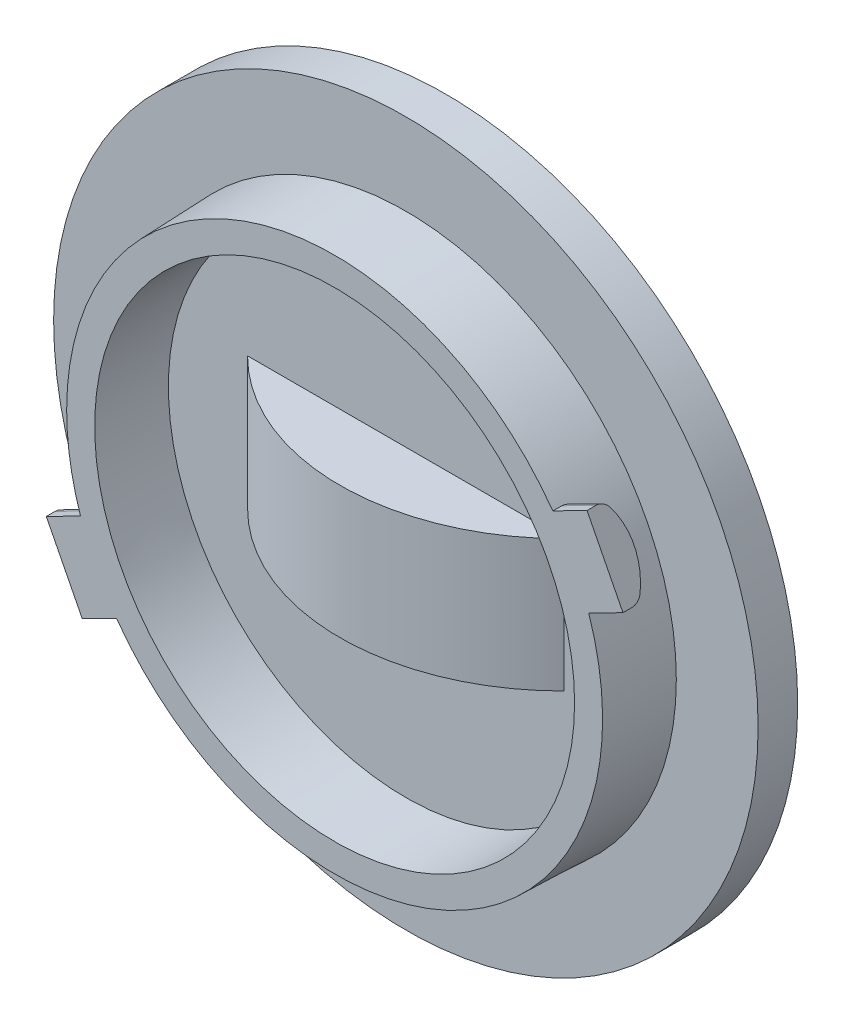
ISO-10303-21;
HEADER;
FILE_DESCRIPTION(('STEP AP214'),'2;1');
FILE_NAME('part.step','',(''),(''),'','','');
FILE_SCHEMA(('AUTOMOTIVE_DESIGN { 1 0 10303 214 1 1 1 1 }'));
ENDSEC;
DATA;
#1=APPLICATION_CONTEXT('core data for automotive mechanical design processes');
#2=APPLICATION_PROTOCOL_DEFINITION('international standard','automotive_design',2000,#1);
#3=PRODUCT_CONTEXT('',#1,'mechanical');
#4=PRODUCT('Part','Part','',(#3));
#5=PRODUCT_RELATED_PRODUCT_CATEGORY('part','',(#4));
#6=PRODUCT_DEFINITION_FORMATION('','',#4);
#7=PRODUCT_DEFINITION_CONTEXT('part definition',#1,'design');
#8=PRODUCT_DEFINITION('design','',#6,#7);
#9=PRODUCT_DEFINITION_SHAPE('','',#8);
#10=(LENGTH_UNIT() NAMED_UNIT(*) SI_UNIT(.MILLI.,.METRE.));
#11=(NAMED_UNIT(*) PLANE_ANGLE_UNIT() SI_UNIT($,.RADIAN.));
#12=(NAMED_UNIT(*) SI_UNIT($,.STERADIAN.) SOLID_ANGLE_UNIT());
#13=UNCERTAINTY_MEASURE_WITH_UNIT(LENGTH_MEASURE(1.E-05),#10,'distance_accuracy_value','');
#14=(GEOMETRIC_REPRESENTATION_CONTEXT(3) GLOBAL_UNCERTAINTY_ASSIGNED_CONTEXT((#13)) GLOBAL_UNIT_ASSIGNED_CONTEXT((#10,
#11,#12)) REPRESENTATION_CONTEXT('',''));
#15=CARTESIAN_POINT('',(0.,0.,0.));
#16=DIRECTION('',(0.,0.,1.));
#17=DIRECTION('',(1.,0.,0.));
#18=AXIS2_PLACEMENT_3D('',#15,#16,#17);
#19=CARTESIAN_POINT('',(0.,0.,-10.18));
#20=DIRECTION('',(0.,0.,-1.));
#21=DIRECTION('',(-1.,0.,0.));
#22=AXIS2_PLACEMENT_3D('',#19,#20,#21);
#23=PLANE('',#22);
#24=CARTESIAN_POINT('',(-24.4705750281702,-1.15689074700472,-10.18));
#25=DIRECTION('',(0.,0.,-1.));
#26=DIRECTION('',(-1.,0.,0.));
#27=AXIS2_PLACEMENT_3D('',#24,#25,#26);
#28=CIRCLE('',#27,1.);
#29=CARTESIAN_POINT('',(-25.4705750281702,-1.15689074700472,-10.18));
#30=VERTEX_POINT('',#29);
#31=EDGE_CURVE('E328',#30,#30,#28,.T.);
#32=ORIENTED_EDGE('',*,*,#31,.F.);
#33=EDGE_LOOP('',(#32));
#34=FACE_BOUND('',#33,.T.);
#35=DIRECTION('',(0.,1.,0.));
#36=VECTOR('',#35,1.);
#37=CARTESIAN_POINT('',(-19.56253912602,0.,-10.18));
#38=LINE('',#37,#36);
#39=CARTESIAN_POINT('',(-19.5625391260178,5.064,-10.18));
#40=VERTEX_POINT('',#39);
#41=CARTESIAN_POINT('',(-19.5625391260178,3.064,-10.18));
#42=VERTEX_POINT('',#41);
#43=EDGE_CURVE('E43',#40,#42,#38,.F.);
#44=ORIENTED_EDGE('',*,*,#43,.T.);
#45=DIRECTION('',(-1.,0.,0.));
#46=VECTOR('',#45,1.);
#47=CARTESIAN_POINT('',(0.,3.064,-10.18));
#48=LINE('',#47,#46);
#49=CARTESIAN_POINT('',(-8.88546087398417,3.064,-10.18));
#50=VERTEX_POINT('',#49);
#51=EDGE_CURVE('E11',#42,#50,#48,.F.);
#52=ORIENTED_EDGE('',*,*,#51,.T.);
#53=DIRECTION('',(0.,1.,0.));
#54=VECTOR('',#53,1.);
#55=CARTESIAN_POINT('',(-8.885460873984,0.,-10.18));
#56=LINE('',#55,#54);
#57=CARTESIAN_POINT('',(-8.88546087398417,5.064,-10.18));
#58=VERTEX_POINT('',#57);
#59=EDGE_CURVE('E166',#50,#58,#56,.T.);
#60=ORIENTED_EDGE('',*,*,#59,.T.);
#61=DIRECTION('',(-1.,0.,0.));
#62=VECTOR('',#61,1.);
#63=CARTESIAN_POINT('',(0.,5.064,-10.18));
#64=LINE('',#63,#62);
#65=EDGE_CURVE('E336',#58,#40,#64,.T.);
#66=ORIENTED_EDGE('',*,*,#65,.T.);
#67=EDGE_LOOP('',(#44,#52,#60,#66));
#68=FACE_BOUND('',#67,.T.);
#69=CARTESIAN_POINT('',(-14.224,4.064,-10.18));
#70=DIRECTION('',(0.,0.,-1.));
#71=DIRECTION('',(-1.,0.,0.));
#72=AXIS2_PLACEMENT_3D('',#69,#70,#71);
#73=CIRCLE('',#72,13.35);
#74=CARTESIAN_POINT('',(-27.574,4.064,-10.18));
#75=VERTEX_POINT('',#74);
#76=EDGE_CURVE('E163',#75,#75,#73,.T.);
#77=ORIENTED_EDGE('',*,*,#76,.T.);
#78=EDGE_LOOP('',(#77));
#79=FACE_BOUND('',#78,.T.);
#80=CARTESIAN_POINT('',(-3.9774249718335,9.284890747006,-10.18));
#81=DIRECTION('',(0.,0.,-1.));
#82=DIRECTION('',(-1.,0.,0.));
#83=AXIS2_PLACEMENT_3D('',#80,#81,#82);
#84=CIRCLE('',#83,1.);
#85=CARTESIAN_POINT('',(-4.9774249718335,9.284890747006,-10.18));
#86=VERTEX_POINT('',#85);
#87=EDGE_CURVE('E323',#86,#86,#84,.T.);
#88=ORIENTED_EDGE('',*,*,#87,.F.);
#89=EDGE_LOOP('',(#88));
#90=FACE_BOUND('',#89,.T.);
#91=ADVANCED_FACE('F33',(#34,#68,#79,#90),#23,.T.);
#92=CARTESIAN_POINT('',(-14.224,1.564,0.));
#93=DIRECTION('',(0.,1.,0.));
#94=DIRECTION('',(0.,0.,1.));
#95=AXIS2_PLACEMENT_3D('',#92,#93,#94);
#96=PLANE('',#95);
#97=DIRECTION('',(-1.,0.,0.));
#98=VECTOR('',#97,1.);
#99=CARTESIAN_POINT('',(0.,1.564,-8.68));
#100=LINE('',#99,#98);
#101=CARTESIAN_POINT('',(-20.224,1.564,-8.68));
#102=VERTEX_POINT('',#101);
#103=CARTESIAN_POINT('',(-8.224,1.564,-8.68));
#104=VERTEX_POINT('',#103);
#105=EDGE_CURVE('E138',#102,#104,#100,.F.);
#106=ORIENTED_EDGE('',*,*,#105,.T.);
#107=CARTESIAN_POINT('',(-14.224,1.564,-14.63));
#108=DIRECTION('',(0.,1.,0.));
#109=DIRECTION('',(0.,0.,1.));
#110=AXIS2_PLACEMENT_3D('',#107,#108,#109);
#111=CIRCLE('',#110,8.45);
#112=EDGE_CURVE('E37',#102,#104,#111,.T.);
#113=ORIENTED_EDGE('',*,*,#112,.F.);
#114=EDGE_LOOP('',(#106,#113));
#115=FACE_BOUND('',#114,.T.);
#116=ADVANCED_FACE('F35',(#115),#96,.F.);
#117=CARTESIAN_POINT('',(-14.224,6.564,0.));
#118=DIRECTION('',(0.,1.,0.));
#119=DIRECTION('',(0.,0.,1.));
#120=AXIS2_PLACEMENT_3D('',#117,#118,#119);
#121=PLANE('',#120);
#122=CARTESIAN_POINT('',(-14.224,6.564,-14.63));
#123=DIRECTION('',(0.,1.,0.));
#124=DIRECTION('',(0.,0.,1.));
#125=AXIS2_PLACEMENT_3D('',#122,#123,#124);
#126=CIRCLE('',#125,8.45);
#127=CARTESIAN_POINT('',(-8.224,6.564,-8.68));
#128=VERTEX_POINT('',#127);
#129=CARTESIAN_POINT('',(-20.224,6.564,-8.68));
#130=VERTEX_POINT('',#129);
#131=EDGE_CURVE('E143',#128,#130,#126,.F.);
#132=ORIENTED_EDGE('',*,*,#131,.F.);
#133=DIRECTION('',(-1.,0.,0.));
#134=VECTOR('',#133,1.);
#135=CARTESIAN_POINT('',(0.,6.564,-8.68));
#136=LINE('',#135,#134);
#137=EDGE_CURVE('E154',#128,#130,#136,.T.);
#138=ORIENTED_EDGE('',*,*,#137,.T.);
#139=EDGE_LOOP('',(#132,#138));
#140=FACE_BOUND('',#139,.T.);
#141=ADVANCED_FACE('F277',(#140),#121,.T.);
#142=CARTESIAN_POINT('',(-14.224,1.564,-14.63));
#143=DIRECTION('',(0.,1.,0.));
#144=DIRECTION('',(0.,0.,1.));
#145=AXIS2_PLACEMENT_3D('',#142,#143,#144);
#146=CYLINDRICAL_SURFACE('',#145,8.45);
#147=ORIENTED_EDGE('',*,*,#131,.T.);
#148=DIRECTION('',(0.,1.,0.));
#149=VECTOR('',#148,1.);
#150=CARTESIAN_POINT('',(-20.224,0.,-8.68));
#151=LINE('',#150,#149);
#152=EDGE_CURVE('E150',#130,#102,#151,.F.);
#153=ORIENTED_EDGE('',*,*,#152,.T.);
#154=ORIENTED_EDGE('',*,*,#112,.T.);
#155=DIRECTION('',(0.,1.,0.));
#156=VECTOR('',#155,1.);
#157=CARTESIAN_POINT('',(-8.224,0.,-8.68));
#158=LINE('',#157,#156);
#159=EDGE_CURVE('E142',#104,#128,#158,.T.);
#160=ORIENTED_EDGE('',*,*,#159,.T.);
#161=EDGE_LOOP('',(#147,#153,#154,#160));
#162=FACE_BOUND('',#161,.T.);
#163=ADVANCED_FACE('F148',(#162),#146,.T.);
#164=CARTESIAN_POINT('',(0.,0.,-8.68));
#165=DIRECTION('',(0.,0.,-1.));
#166=DIRECTION('',(-1.,0.,0.));
#167=AXIS2_PLACEMENT_3D('',#164,#165,#166);
#168=PLANE('',#167);
#169=ORIENTED_EDGE('',*,*,#137,.F.);
#170=ORIENTED_EDGE('',*,*,#159,.F.);
#171=ORIENTED_EDGE('',*,*,#105,.F.);
#172=ORIENTED_EDGE('',*,*,#152,.F.);
#173=EDGE_LOOP('',(#169,#170,#171,#172));
#174=FACE_BOUND('',#173,.T.);
#175=CARTESIAN_POINT('',(-14.224,4.064,-8.68));
#176=DIRECTION('',(0.,0.,1.));
#177=DIRECTION('',(1.,0.,0.));
#178=AXIS2_PLACEMENT_3D('',#175,#176,#177);
#179=CIRCLE('',#178,9.00000000000015);
#180=CARTESIAN_POINT('',(-5.22399999999985,4.064,-8.68));
#181=VERTEX_POINT('',#180);
#182=EDGE_CURVE('E217',#181,#181,#179,.T.);
#183=ORIENTED_EDGE('',*,*,#182,.T.);
#184=EDGE_LOOP('',(#183));
#185=FACE_BOUND('',#184,.T.);
#186=ADVANCED_FACE('F152',(#174,#185),#168,.F.);
#187=CARTESIAN_POINT('',(-58.57091041054,-19.65420569825,-6.312050807569));
#188=DIRECTION('',(0.891006524188393,0.453990499739497,0.));
#189=DIRECTION('',(-0.453990499739497,0.891006524188393,0.));
#190=AXIS2_PLACEMENT_3D('',#187,#188,#189);
#191=CYLINDRICAL_SURFACE('',#190,0.5);
#192=DIRECTION('',(0.891006524188393,0.453990499739497,0.));
#193=VECTOR('',#192,1.);
#194=CARTESIAN_POINT('',(-3.40993684715936,8.17113259176898,-6.74506350946075));
#195=LINE('',#194,#193);
#196=CARTESIAN_POINT('',(-3.40993684715921,8.17113259176922,-6.74506350946097));
#197=VERTEX_POINT('',#196);
#198=CARTESIAN_POINT('',(-4.65252209977524,7.5380037823946,-6.74506350946078));
#199=VERTEX_POINT('',#198);
#200=EDGE_CURVE('E376',#197,#199,#195,.F.);
#201=ORIENTED_EDGE('',*,*,#200,.F.);
#202=CARTESIAN_POINT('',(-3.52343447209409,8.39388422281651,-6.312050807569));
#203=DIRECTION('',(0.891006524188393,0.453990499739497,0.));
#204=DIRECTION('',(-0.453990499739497,0.891006524188393,0.));
#205=AXIS2_PLACEMENT_3D('',#202,#203,#204);
#206=CIRCLE('',#205,0.5);
#207=CARTESIAN_POINT('',(-3.2964392222241,7.94838096072202,-6.312050807569));
#208=VERTEX_POINT('',#207);
#209=EDGE_CURVE('E272',#208,#197,#206,.T.);
#210=ORIENTED_EDGE('',*,*,#209,.F.);
#211=DIRECTION('',(0.891006524188393,0.453990499739497,0.));
#212=VECTOR('',#211,1.);
#213=CARTESIAN_POINT('',(-4.50852004066,7.330794936885,-6.312050807569));
#214=LINE('',#213,#212);
#215=CARTESIAN_POINT('',(-4.58300637958424,7.29284225156363,-6.31205080756894));
#216=VERTEX_POINT('',#215);
#217=EDGE_CURVE('E158',#216,#208,#214,.T.);
#218=ORIENTED_EDGE('',*,*,#217,.F.);
#219=CARTESIAN_POINT('',(-4.58300637958267,7.29284225156463,-6.31205080756887));
#220=CARTESIAN_POINT('',(-4.58211902532399,7.29326689250219,-6.34010161204957));
#221=CARTESIAN_POINT('',(-4.58199969177409,7.29600262277718,-6.36812796429022));
#222=CARTESIAN_POINT('',(-4.58328126314994,7.30587979040041,-6.42331053144108));
#223=CARTESIAN_POINT('',(-4.58467961113743,7.31301380892771,-6.45046813075209));
#224=CARTESIAN_POINT('',(-4.5889781283262,7.33147507139072,-6.50319481948987));
#225=CARTESIAN_POINT('',(-4.59187848461878,7.34280283765273,-6.52876371058148));
#226=CARTESIAN_POINT('',(-4.59913365805207,7.36929666210863,-6.57762370453765));
#227=CARTESIAN_POINT('',(-4.60348940257336,7.38446516614328,-6.60091334278601));
#228=CARTESIAN_POINT('',(-4.61362067187574,7.41832445705081,-6.64475631372771));
#229=CARTESIAN_POINT('',(-4.6194084032012,7.43704518602596,-6.66528364671262));
#230=CARTESIAN_POINT('',(-4.63226533361311,7.47733899246289,-6.70276627884086));
#231=CARTESIAN_POINT('',(-4.63933169828259,7.49890573294703,-6.71972930293742));
#232=CARTESIAN_POINT('',(-4.64878037261052,7.52698357200546,-6.73825935689551));
#233=CARTESIAN_POINT('',(-4.65063584659399,7.53246483339741,-6.74172060310438));
#234=CARTESIAN_POINT('',(-4.65252209977517,7.53800378239442,-6.74506350946082));
#235=B_SPLINE_CURVE_WITH_KNOTS('',3,(#219,#220,#221,#222,#223,#224,#225,#226,#227,#228,#229,
#230,#231,#232,#233,#234),.UNSPECIFIED.,.F.,.F.,(4,2,2,2,2,2,2,4),(0.,0.0840838207668479,
0.168026199559486,0.25197903679458,0.335985471537736,0.420734277244317,0.50529746724014,
0.525520310353774),.UNSPECIFIED.);
#236=EDGE_CURVE('E161',#216,#199,#235,.T.);
#237=ORIENTED_EDGE('',*,*,#236,.T.);
#238=EDGE_LOOP('',(#201,#210,#218,#237));
#239=FACE_BOUND('',#238,.T.);
#240=ADVANCED_FACE('F259',(#239),#191,.T.);
#241=CARTESIAN_POINT('',(33.93212,29.72309492654,-6.312050807569));
#242=DIRECTION('',(-0.891006524188393,-0.453990499739497,0.));
#243=DIRECTION('',(0.453990499739497,-0.891006524188393,0.));
#244=AXIS2_PLACEMENT_3D('',#241,#242,#243);
#245=CYLINDRICAL_SURFACE('',#244,0.5);
#246=CARTESIAN_POINT('',(-4.43141547157249,10.1758972711943,-6.312050807569));
#247=DIRECTION('',(-0.891006524188393,-0.453990499739497,0.));
#248=DIRECTION('',(0.453990499739497,-0.891006524188393,0.));
#249=AXIS2_PLACEMENT_3D('',#246,#247,#248);
#250=CIRCLE('',#249,0.5);
#251=CARTESIAN_POINT('',(-4.54491309650764,10.3986489022409,-6.74506350946121));
#252=VERTEX_POINT('',#251);
#253=CARTESIAN_POINT('',(-4.65841072144301,10.62140053329,-6.312050807569));
#254=VERTEX_POINT('',#253);
#255=EDGE_CURVE('E409',#252,#254,#250,.F.);
#256=ORIENTED_EDGE('',*,*,#255,.F.);
#257=DIRECTION('',(0.891006524188393,0.453990499739497,0.));
#258=VECTOR('',#257,1.);
#259=CARTESIAN_POINT('',(-4.54491309650826,10.3986489022403,-6.74506350946123));
#260=LINE('',#259,#258);
#261=CARTESIAN_POINT('',(-5.78749834912447,9.76552009286627,-6.74506350946122));
#262=VERTEX_POINT('',#261);
#263=EDGE_CURVE('E371',#262,#252,#260,.T.);
#264=ORIENTED_EDGE('',*,*,#263,.F.);
#265=CARTESIAN_POINT('',(-5.78749834912464,9.76552009286651,-6.74506350946121));
#266=CARTESIAN_POINT('',(-5.80175891588662,9.78574359152614,-6.73094756052362));
#267=CARTESIAN_POINT('',(-5.81547724440093,9.80486682357144,-6.71472187922432));
#268=CARTESIAN_POINT('',(-5.84140358289956,9.84043363892302,-6.67860204049876));
#269=CARTESIAN_POINT('',(-5.85361343018109,9.85688048990735,-6.65871242074983));
#270=CARTESIAN_POINT('',(-5.87614463310771,9.88668140905615,-6.61575820910445));
#271=CARTESIAN_POINT('',(-5.88646420560405,9.90003256008409,-6.59269065494097));
#272=CARTESIAN_POINT('',(-5.90484898579757,9.9232603221763,-6.54404921721269));
#273=CARTESIAN_POINT('',(-5.91291447478179,9.93313736681405,-6.51847564691202));
#274=CARTESIAN_POINT('',(-5.92702580665826,9.949752938816,-6.46347289228939));
#275=CARTESIAN_POINT('',(-5.93286621715199,9.95618824096055,-6.43389851510111));
#276=CARTESIAN_POINT('',(-5.94137602148812,9.96451057718513,-6.37357840309545));
#277=CARTESIAN_POINT('',(-5.94403531285673,9.9663831405161,-6.3428292548219));
#278=CARTESIAN_POINT('',(-5.9449778788017,9.96586182413023,-6.31205080756886));
#279=B_SPLINE_CURVE_WITH_KNOTS('',3,(#265,#266,#267,#268,#269,#270,#271,#272,#273,#274,#275,
#276,#277,#278),.UNSPECIFIED.,.F.,.F.,(4,2,2,2,2,2,4),(0.,0.0853568727200456,0.170608735682245,
0.25594060953047,0.341261830056113,0.433207613181306,0.525444625442435),.UNSPECIFIED.);
#280=CARTESIAN_POINT('',(-5.94497787880384,9.96586182413008,-6.31205080756893));
#281=VERTEX_POINT('',#280);
#282=EDGE_CURVE('E264',#262,#281,#279,.T.);
#283=ORIENTED_EDGE('',*,*,#282,.T.);
#284=DIRECTION('',(-0.891006524188393,-0.453990499739497,0.));
#285=VECTOR('',#284,1.);
#286=CARTESIAN_POINT('',(-4.658410721443,10.62140053329,-6.312050807569));
#287=LINE('',#286,#285);
#288=EDGE_CURVE('E404',#254,#281,#287,.T.);
#289=ORIENTED_EDGE('',*,*,#288,.F.);
#290=EDGE_LOOP('',(#256,#264,#283,#289));
#291=FACE_BOUND('',#290,.T.);
#292=ADVANCED_FACE('F254',(#291),#245,.T.);
#293=CARTESIAN_POINT('',(-4.50852004066,7.330794936885,-4.88));
#294=DIRECTION('',(0.453990499739497,-0.891006524188393,0.));
#295=DIRECTION('',(0.891006524188393,0.453990499739497,0.));
#296=AXIS2_PLACEMENT_3D('',#293,#294,#295);
#297=PLANE('',#296);
#298=DIRECTION('',(0.0314396863944734,0.0160193203421071,-0.999377269851178));
#299=VECTOR('',#298,1.);
#300=CARTESIAN_POINT('',(-4.59345245793074,7.28751970879848,-5.98));
#301=LINE('',#300,#299);
#302=CARTESIAN_POINT('',(-4.59345245792915,7.28751970879962,-5.97999999999987));
#303=VERTEX_POINT('',#302);
#304=EDGE_CURVE('E271',#303,#216,#301,.T.);
#305=ORIENTED_EDGE('',*,*,#304,.T.);
#306=ORIENTED_EDGE('',*,*,#217,.T.);
#307=DIRECTION('',(0.,0.,1.));
#308=VECTOR('',#307,1.);
#309=CARTESIAN_POINT('',(-3.296439222224,7.948380960722,-4.88));
#310=LINE('',#309,#308);
#311=CARTESIAN_POINT('',(-3.296439222224,7.948380960722,-5.98));
#312=VERTEX_POINT('',#311);
#313=EDGE_CURVE('E418',#312,#208,#310,.F.);
#314=ORIENTED_EDGE('',*,*,#313,.F.);
#315=DIRECTION('',(0.891006524188599,0.453990499739093,0.));
#316=VECTOR('',#315,1.);
#317=CARTESIAN_POINT('',(-4.593452457931,7.287519708799,-5.98));
#318=LINE('',#317,#316);
#319=EDGE_CURVE('E368',#303,#312,#318,.T.);
#320=ORIENTED_EDGE('',*,*,#319,.F.);
#321=EDGE_LOOP('',(#305,#306,#314,#320));
#322=FACE_BOUND('',#321,.T.);
#323=ADVANCED_FACE('F250',(#322),#297,.T.);
#324=CARTESIAN_POINT('',(-3.296439222224,7.948380960722,-4.88));
#325=DIRECTION('',(0.891006524188393,0.453990499739497,0.));
#326=DIRECTION('',(-0.453990499739497,0.891006524188393,0.));
#327=AXIS2_PLACEMENT_3D('',#324,#325,#326);
#328=PLANE('',#327);
#329=CARTESIAN_POINT('',(-3.97742497183391,9.28489074700505,-4.58));
#330=DIRECTION('',(0.891006524188393,0.453990499739497,0.));
#331=DIRECTION('',(-0.453990499739497,0.891006524188393,0.));
#332=AXIS2_PLACEMENT_3D('',#329,#330,#331);
#333=CIRCLE('',#332,2.5);
#334=EDGE_CURVE('E379',#252,#197,#333,.F.);
#335=ORIENTED_EDGE('',*,*,#334,.F.);
#336=ORIENTED_EDGE('',*,*,#255,.T.);
#337=DIRECTION('',(0.,0.,1.));
#338=VECTOR('',#337,1.);
#339=CARTESIAN_POINT('',(-4.658410721443,10.62140053329,-4.88));
#340=LINE('',#339,#338);
#341=CARTESIAN_POINT('',(-4.658410721443,10.62140053329,-5.98));
#342=VERTEX_POINT('',#341);
#343=EDGE_CURVE('E408',#342,#254,#340,.F.);
#344=ORIENTED_EDGE('',*,*,#343,.F.);
#345=DIRECTION('',(-0.453990499739252,0.891006524188518,0.));
#346=VECTOR('',#345,1.);
#347=CARTESIAN_POINT('',(-3.296439222224,7.948380960722,-5.98));
#348=LINE('',#347,#346);
#349=EDGE_CURVE('E365',#312,#342,#348,.T.);
#350=ORIENTED_EDGE('',*,*,#349,.F.);
#351=ORIENTED_EDGE('',*,*,#313,.T.);
#352=ORIENTED_EDGE('',*,*,#209,.T.);
#353=EDGE_LOOP('',(#335,#336,#344,#350,#351,#352));
#354=FACE_BOUND('',#353,.T.);
#355=ADVANCED_FACE('F246',(#354),#328,.T.);
#356=CARTESIAN_POINT('',(-4.658410721443,10.62140053329,-4.88));
#357=DIRECTION('',(-0.453990499739497,0.891006524188393,0.));
#358=DIRECTION('',(-0.891006524188393,-0.453990499739497,0.));
#359=AXIS2_PLACEMENT_3D('',#356,#357,#358);
#360=PLANE('',#359);
#361=ORIENTED_EDGE('',*,*,#343,.T.);
#362=ORIENTED_EDGE('',*,*,#288,.T.);
#363=DIRECTION('',(-0.0314396863944761,-0.0160193203421044,0.999377269851178));
#364=VECTOR('',#363,1.);
#365=CARTESIAN_POINT('',(-5.94497787880599,9.96586182412994,-6.312050807569));
#366=LINE('',#365,#364);
#367=CARTESIAN_POINT('',(-5.95542395714862,9.96053928136583,-5.97999999999976));
#368=VERTEX_POINT('',#367);
#369=EDGE_CURVE('E405',#281,#368,#366,.T.);
#370=ORIENTED_EDGE('',*,*,#369,.T.);
#371=DIRECTION('',(-0.891006524187765,-0.45399049974073,0.));
#372=VECTOR('',#371,1.);
#373=CARTESIAN_POINT('',(-4.658410721443,10.62140053329,-5.98));
#374=LINE('',#373,#372);
#375=EDGE_CURVE('E360',#342,#368,#374,.T.);
#376=ORIENTED_EDGE('',*,*,#375,.F.);
#377=EDGE_LOOP('',(#361,#362,#370,#376));
#378=FACE_BOUND('',#377,.T.);
#379=ADVANCED_FACE('F242',(#378),#360,.T.);
#380=CARTESIAN_POINT('',(-23.93947995934,0.7972050631146,-4.88));
#381=DIRECTION('',(-0.453990499739497,0.891006524188393,0.));
#382=DIRECTION('',(-0.891006524188393,-0.453990499739497,0.));
#383=AXIS2_PLACEMENT_3D('',#380,#381,#382);
#384=PLANE('',#383);
#385=DIRECTION('',(-0.0314396863826521,-0.016019320336083,-0.999377269851646));
#386=VECTOR('',#385,1.);
#387=CARTESIAN_POINT('',(-23.8545475420698,0.840480291200854,-5.98));
#388=LINE('',#387,#386);
#389=CARTESIAN_POINT('',(-23.8545475420712,0.840480291200395,-5.97999999999987));
#390=VERTEX_POINT('',#389);
#391=CARTESIAN_POINT('',(-23.8649936204141,0.835157748437371,-6.31205080756887));
#392=VERTEX_POINT('',#391);
#393=EDGE_CURVE('E398',#390,#392,#388,.T.);
#394=ORIENTED_EDGE('',*,*,#393,.T.);
#395=DIRECTION('',(-0.891006524188393,-0.453990499739497,0.));
#396=VECTOR('',#395,1.);
#397=CARTESIAN_POINT('',(29.3802919264403,27.9649858001542,-6.312050807569));
#398=LINE('',#397,#396);
#399=CARTESIAN_POINT('',(-25.1515607777778,0.179619039278523,-6.312050807569));
#400=VERTEX_POINT('',#399);
#401=EDGE_CURVE('E216',#400,#392,#398,.F.);
#402=ORIENTED_EDGE('',*,*,#401,.F.);
#403=DIRECTION('',(0.,0.,1.));
#404=VECTOR('',#403,1.);
#405=CARTESIAN_POINT('',(-25.15156077778,0.1796190392778,-4.88));
#406=LINE('',#405,#404);
#407=CARTESIAN_POINT('',(-25.15156077778,0.1796190392778,-5.98));
#408=VERTEX_POINT('',#407);
#409=EDGE_CURVE('E386',#408,#400,#406,.F.);
#410=ORIENTED_EDGE('',*,*,#409,.F.);
#411=DIRECTION('',(-0.891006524188885,-0.453990499738533,0.));
#412=VECTOR('',#411,1.);
#413=CARTESIAN_POINT('',(-23.85454754207,0.8404802912013,-5.98));
#414=LINE('',#413,#412);
#415=EDGE_CURVE('E357',#390,#408,#414,.T.);
#416=ORIENTED_EDGE('',*,*,#415,.F.);
#417=EDGE_LOOP('',(#394,#402,#410,#416));
#418=FACE_BOUND('',#417,.T.);
#419=ADVANCED_FACE('F238',(#418),#384,.T.);
#420=CARTESIAN_POINT('',(-23.78958927856,-2.493400533287,-4.88));
#421=DIRECTION('',(0.453990499739497,-0.891006524188393,0.));
#422=DIRECTION('',(0.891006524188393,0.453990499739497,0.));
#423=AXIS2_PLACEMENT_3D('',#420,#421,#422);
#424=PLANE('',#423);
#425=DIRECTION('',(0.,0.,1.));
#426=VECTOR('',#425,1.);
#427=CARTESIAN_POINT('',(-23.7895892785613,-2.49340053328769,-4.88));
#428=LINE('',#427,#426);
#429=CARTESIAN_POINT('',(-23.7895892785595,-2.49340053328803,-6.312050807569));
#430=VERTEX_POINT('',#429);
#431=CARTESIAN_POINT('',(-23.7895892785604,-2.49340053328723,-5.98));
#432=VERTEX_POINT('',#431);
#433=EDGE_CURVE('E389',#430,#432,#428,.T.);
#434=ORIENTED_EDGE('',*,*,#433,.F.);
#435=DIRECTION('',(0.891006524188393,0.453990499739497,0.));
#436=VECTOR('',#435,1.);
#437=CARTESIAN_POINT('',(-62.1531247501303,-22.0405981886342,-6.312050807569));
#438=LINE('',#437,#436);
#439=CARTESIAN_POINT('',(-22.503022121199,-1.8378618241293,-6.312050807569));
#440=VERTEX_POINT('',#439);
#441=EDGE_CURVE('E380',#440,#430,#438,.F.);
#442=ORIENTED_EDGE('',*,*,#441,.F.);
#443=DIRECTION('',(0.031439686406399,0.0160193203481833,0.999377269850705));
#444=VECTOR('',#443,1.);
#445=CARTESIAN_POINT('',(-22.5030221211998,-1.83786182412837,-6.312050807569));
#446=LINE('',#445,#444);
#447=CARTESIAN_POINT('',(-22.4925760428523,-1.83253928136403,-5.97999999999982));
#448=VERTEX_POINT('',#447);
#449=EDGE_CURVE('E396',#440,#448,#446,.T.);
#450=ORIENTED_EDGE('',*,*,#449,.T.);
#451=DIRECTION('',(0.891006524189024,0.453990499738259,0.));
#452=VECTOR('',#451,1.);
#453=CARTESIAN_POINT('',(-23.78958927856,-2.493400533287,-5.98));
#454=LINE('',#453,#452);
#455=EDGE_CURVE('E350',#432,#448,#454,.T.);
#456=ORIENTED_EDGE('',*,*,#455,.F.);
#457=EDGE_LOOP('',(#434,#442,#450,#456));
#458=FACE_BOUND('',#457,.T.);
#459=ADVANCED_FACE('F234',(#458),#424,.T.);
#460=CARTESIAN_POINT('',(-14.224,4.064,-5.98));
#461=DIRECTION('',(0.,0.,1.));
#462=DIRECTION('',(1.,0.,0.));
#463=AXIS2_PLACEMENT_3D('',#460,#461,#462);
#464=CONICAL_SURFACE('',#463,9.09428607762785,0.0349065850398804);
#465=CARTESIAN_POINT('',(-14.224,4.064,-5.97999999999993));
#466=DIRECTION('',(0.,0.,1.));
#467=DIRECTION('',(1.,0.,0.));
#468=AXIS2_PLACEMENT_3D('',#465,#466,#467);
#469=CIRCLE('',#468,9.09428607762785);
#470=CARTESIAN_POINT('',(-5.12971392237215,4.064,-5.97999999999993));
#471=VERTEX_POINT('',#470);
#472=EDGE_CURVE('E353',#471,#471,#469,.F.);
#473=ORIENTED_EDGE('',*,*,#472,.F.);
#474=EDGE_LOOP('',(#473));
#475=FACE_BOUND('',#474,.T.);
#476=ORIENTED_EDGE('',*,*,#182,.F.);
#477=EDGE_LOOP('',(#476));
#478=FACE_BOUND('',#477,.T.);
#479=ADVANCED_FACE('F230',(#475,#478),#464,.F.);
#480=CARTESIAN_POINT('',(-25.15156077778,0.1796190392778,-4.88));
#481=DIRECTION('',(-0.891006524188393,-0.453990499739497,0.));
#482=DIRECTION('',(0.453990499739497,-0.891006524188393,0.));
#483=AXIS2_PLACEMENT_3D('',#480,#481,#482);
#484=PLANE('',#483);
#485=CARTESIAN_POINT('',(-24.4705750281653,-1.15689074700262,-4.58));
#486=DIRECTION('',(-0.891006524188393,-0.453990499739497,0.));
#487=DIRECTION('',(0.453990499739497,-0.891006524188393,0.));
#488=AXIS2_PLACEMENT_3D('',#485,#486,#487);
#489=CIRCLE('',#488,2.5);
#490=CARTESIAN_POINT('',(-23.9030869034925,-2.27064890224101,-6.74506350946001));
#491=VERTEX_POINT('',#490);
#492=CARTESIAN_POINT('',(-25.0380631528399,-0.0431325917685367,-6.74506350946159));
#493=VERTEX_POINT('',#492);
#494=EDGE_CURVE('E349',#491,#493,#489,.F.);
#495=ORIENTED_EDGE('',*,*,#494,.F.);
#496=CARTESIAN_POINT('',(-24.0165845284287,-2.04789727119489,-6.312050807569));
#497=DIRECTION('',(0.891006524188393,0.453990499739497,0.));
#498=DIRECTION('',(-0.453990499739497,0.891006524188393,0.));
#499=AXIS2_PLACEMENT_3D('',#496,#497,#498);
#500=CIRCLE('',#499,0.5);
#501=EDGE_CURVE('E383',#430,#491,#500,.T.);
#502=ORIENTED_EDGE('',*,*,#501,.F.);
#503=ORIENTED_EDGE('',*,*,#433,.T.);
#504=DIRECTION('',(0.453990499739947,-0.891006524188164,0.));
#505=VECTOR('',#504,1.);
#506=CARTESIAN_POINT('',(-25.15156077778,0.1796190392778,-5.98));
#507=LINE('',#506,#505);
#508=EDGE_CURVE('E354',#408,#432,#507,.T.);
#509=ORIENTED_EDGE('',*,*,#508,.F.);
#510=ORIENTED_EDGE('',*,*,#409,.T.);
#511=CARTESIAN_POINT('',(-24.9245655279056,-0.265884222815562,-6.312050807569));
#512=DIRECTION('',(-0.891006524188393,-0.453990499739497,0.));
#513=DIRECTION('',(0.453990499739497,-0.891006524188393,0.));
#514=AXIS2_PLACEMENT_3D('',#511,#512,#513);
#515=CIRCLE('',#514,0.5);
#516=EDGE_CURVE('E215',#493,#400,#515,.F.);
#517=ORIENTED_EDGE('',*,*,#516,.F.);
#518=EDGE_LOOP('',(#495,#502,#503,#509,#510,#517));
#519=FACE_BOUND('',#518,.T.);
#520=ADVANCED_FACE('F224',(#519),#484,.T.);
#521=CARTESIAN_POINT('',(29.60728717631,27.51948253806,-6.312050807569));
#522=DIRECTION('',(-0.891006524188393,-0.453990499739497,0.));
#523=DIRECTION('',(0.453990499739497,-0.891006524188393,0.));
#524=AXIS2_PLACEMENT_3D('',#521,#522,#523);
#525=CYLINDRICAL_SURFACE('',#524,0.5);
#526=DIRECTION('',(-0.891006524188393,-0.453990499739497,0.));
#527=VECTOR('',#526,1.);
#528=CARTESIAN_POINT('',(-25.0380631528438,-0.0431325917706895,-6.74506350946186));
#529=LINE('',#528,#527);
#530=CARTESIAN_POINT('',(-23.7954779002247,0.58999621760524,-6.7450635094616));
#531=VERTEX_POINT('',#530);
#532=EDGE_CURVE('E346',#493,#531,#529,.F.);
#533=ORIENTED_EDGE('',*,*,#532,.F.);
#534=ORIENTED_EDGE('',*,*,#516,.T.);
#535=ORIENTED_EDGE('',*,*,#401,.T.);
#536=CARTESIAN_POINT('',(-23.8649936204175,0.835157748436037,-6.31205080756874));
#537=CARTESIAN_POINT('',(-23.8658809746762,0.834733107498479,-6.34010161204944));
#538=CARTESIAN_POINT('',(-23.8660003082261,0.831997377223502,-6.36812796429009));
#539=CARTESIAN_POINT('',(-23.8647187368503,0.822120209600285,-6.42331053144096));
#540=CARTESIAN_POINT('',(-23.8633203888628,0.814986191072994,-6.45046813075197));
#541=CARTESIAN_POINT('',(-23.8590218716741,0.796524928609989,-6.50319481948975));
#542=CARTESIAN_POINT('',(-23.8561215153815,0.785197162347991,-6.52876371058136));
#543=CARTESIAN_POINT('',(-23.8488663419482,0.758703337892096,-6.57762370453754));
#544=CARTESIAN_POINT('',(-23.8445105974269,0.743534833857455,-6.6009133427859));
#545=CARTESIAN_POINT('',(-23.8343793281245,0.709675542949937,-6.64475631372761));
#546=CARTESIAN_POINT('',(-23.8285915967991,0.690954813974784,-6.66528364671253));
#547=CARTESIAN_POINT('',(-23.8157346663872,0.650661007537861,-6.70276627884077));
#548=CARTESIAN_POINT('',(-23.8086683017177,0.629094267053734,-6.71972930293734));
#549=CARTESIAN_POINT('',(-23.7992196273896,0.601016427994989,-6.73825935689565));
#550=CARTESIAN_POINT('',(-23.7973641534061,0.595535166602714,-6.74172060310471));
#551=CARTESIAN_POINT('',(-23.7954779002247,0.589996217605375,-6.74506350946134));
#552=B_SPLINE_CURVE_WITH_KNOTS('',3,(#536,#537,#538,#539,#540,#541,#542,#543,#544,#545,#546,
#547,#548,#549,#550,#551),.UNSPECIFIED.,.F.,.F.,(4,2,2,2,2,2,2,4),(0.,0.0840838207668487,
0.168026199559489,0.251979036794581,0.335985471537738,0.420734277244318,0.505297467240148,
0.52552031035496),.UNSPECIFIED.);
#553=EDGE_CURVE('E209',#392,#531,#552,.T.);
#554=ORIENTED_EDGE('',*,*,#553,.T.);
#555=EDGE_LOOP('',(#533,#534,#535,#554));
#556=FACE_BOUND('',#555,.T.);
#557=ADVANCED_FACE('F219',(#556),#525,.T.);
#558=CARTESIAN_POINT('',(-62.38012,-21.59509492654,-6.312050807569));
#559=DIRECTION('',(0.891006524188393,0.453990499739497,0.));
#560=DIRECTION('',(-0.453990499739497,0.891006524188393,0.));
#561=AXIS2_PLACEMENT_3D('',#558,#559,#560);
#562=CYLINDRICAL_SURFACE('',#561,0.5);
#563=ORIENTED_EDGE('',*,*,#501,.T.);
#564=DIRECTION('',(-0.891006524188393,-0.453990499739497,0.));
#565=VECTOR('',#564,1.);
#566=CARTESIAN_POINT('',(-23.9030869034948,-2.27064890224211,-6.74506350946005));
#567=LINE('',#566,#565);
#568=CARTESIAN_POINT('',(-22.6605016508752,-1.63752009286671,-6.74506350946038));
#569=VERTEX_POINT('',#568);
#570=EDGE_CURVE('E342',#569,#491,#567,.T.);
#571=ORIENTED_EDGE('',*,*,#570,.F.);
#572=CARTESIAN_POINT('',(-22.6605016508748,-1.63752009286722,-6.74506350946072));
#573=CARTESIAN_POINT('',(-22.6462410841129,-1.65774359152682,-6.73094756052309));
#574=CARTESIAN_POINT('',(-22.6325227555986,-1.6768668235721,-6.71472187922374));
#575=CARTESIAN_POINT('',(-22.6065964171,-1.71243363892361,-6.67860204049809));
#576=CARTESIAN_POINT('',(-22.5943865698185,-1.72888048990791,-6.65871242074912));
#577=CARTESIAN_POINT('',(-22.5718553668919,-1.75868140905663,-6.61575820910366));
#578=CARTESIAN_POINT('',(-22.5615357943956,-1.77203256008453,-6.59269065494017));
#579=CARTESIAN_POINT('',(-22.5431510142021,-1.79526032217666,-6.54404921721184));
#580=CARTESIAN_POINT('',(-22.535085525218,-1.80513736681437,-6.51847564691113));
#581=CARTESIAN_POINT('',(-22.5209741933416,-1.82175293881617,-6.46347289228863));
#582=CARTESIAN_POINT('',(-22.5151337828479,-1.82818824096065,-6.43389851510053));
#583=CARTESIAN_POINT('',(-22.5066239785118,-1.83651057718514,-6.37357840309524));
#584=CARTESIAN_POINT('',(-22.5039646871432,-1.83838314051609,-6.34282925482188));
#585=CARTESIAN_POINT('',(-22.5030221211983,-1.83786182413023,-6.31205080756902));
#586=B_SPLINE_CURVE_WITH_KNOTS('',3,(#572,#573,#574,#575,#576,#577,#578,#579,#580,#581,#582,
#583,#584,#585),.UNSPECIFIED.,.F.,.F.,(4,2,2,2,2,2,4),(0.,0.0853568727200345,0.170608735682221,
0.255940609530443,0.341261830056081,0.433207613180715,0.525444625441274),.UNSPECIFIED.);
#587=EDGE_CURVE('E201',#569,#440,#586,.T.);
#588=ORIENTED_EDGE('',*,*,#587,.T.);
#589=ORIENTED_EDGE('',*,*,#441,.T.);
#590=EDGE_LOOP('',(#563,#571,#588,#589));
#591=FACE_BOUND('',#590,.T.);
#592=ADVANCED_FACE('F223',(#591),#562,.T.);
#593=CARTESIAN_POINT('',(-3.977424971834,9.284890747005,-4.58));
#594=DIRECTION('',(0.891006524188393,0.453990499739497,0.));
#595=DIRECTION('',(-0.453990499739497,0.891006524188393,0.));
#596=AXIS2_PLACEMENT_3D('',#593,#594,#595);
#597=CYLINDRICAL_SURFACE('',#596,2.5);
#598=CARTESIAN_POINT('',(-5.78749834912457,9.7655200928664,-6.74506350946098));
#599=CARTESIAN_POINT('',(-5.75308189275329,9.71672996816876,-6.77919005594919));
#600=CARTESIAN_POINT('',(-5.71839998389935,9.66644521070234,-6.81091474529989));
#601=CARTESIAN_POINT('',(-5.64883954110661,9.56316133962227,-6.86935071387231));
#602=CARTESIAN_POINT('',(-5.6139609839068,9.51016189863572,-6.89606138661636));
#603=CARTESIAN_POINT('',(-5.5443650726045,9.40175896525756,-6.94424084404244));
#604=CARTESIAN_POINT('',(-5.50964765526517,9.34635652329412,-6.96571189246801));
#605=CARTESIAN_POINT('',(-5.44069840550982,9.23348583422629,-7.00325236463029));
#606=CARTESIAN_POINT('',(-5.40646654160551,9.1760177219434,-7.0193221401895));
#607=CARTESIAN_POINT('',(-5.30488090857906,9.00088992820347,-7.05923570790694));
#608=CARTESIAN_POINT('',(-5.23866236887091,8.88054593660353,-7.07476632267967));
#609=CARTESIAN_POINT('',(-5.11164817407326,8.63634857592751,-7.08300152567769));
#610=CARTESIAN_POINT('',(-5.05085212835341,8.51249546049312,-7.07570775951388));
#611=CARTESIAN_POINT('',(-4.93711701550091,8.26671703978975,-7.03887525718141));
#612=CARTESIAN_POINT('',(-4.88407768964813,8.14478958266962,-7.0096573497903));
#613=CARTESIAN_POINT('',(-4.78583762072844,7.90477442737969,-6.93032010206829));
#614=CARTESIAN_POINT('',(-4.74062512604402,7.78668119277442,-6.88023248873377));
#615=CARTESIAN_POINT('',(-4.69137273435725,7.64963596283777,-6.80873556824504));
#616=CARTESIAN_POINT('',(-4.68337376752007,7.6270745601165,-6.79651066064332));
#617=CARTESIAN_POINT('',(-4.66770562864954,7.58229074507216,-6.77133331579347));
#618=CARTESIAN_POINT('',(-4.66003600792993,7.5600679000049,-6.75838192762075));
#619=CARTESIAN_POINT('',(-4.65252209977522,7.53800378239453,-6.7450635094606));
#620=B_SPLINE_CURVE_WITH_KNOTS('',3,(#598,#599,#600,#601,#602,#603,#604,#605,#606,#607,#608,
#609,#610,#611,#612,#613,#614,#615,#616,#617,#618,#619),.UNSPECIFIED.,.F.,.F.,(4,2,2,2,2,2,2,2,
2,2,4),(0.,0.206258971452496,0.412542875205924,0.618737497004566,0.824918685308484,
1.23742838722784,1.64990834837041,2.05646717370997,2.46241017353448,2.54303967994322,
2.62355560940181),.UNSPECIFIED.);
#621=EDGE_CURVE('E345',#262,#199,#620,.T.);
#622=ORIENTED_EDGE('',*,*,#621,.F.);
#623=ORIENTED_EDGE('',*,*,#263,.T.);
#624=ORIENTED_EDGE('',*,*,#334,.T.);
#625=ORIENTED_EDGE('',*,*,#200,.T.);
#626=EDGE_LOOP('',(#622,#623,#624,#625));
#627=FACE_BOUND('',#626,.T.);
#628=ADVANCED_FACE('F445',(#627),#597,.T.);
#629=CARTESIAN_POINT('',(0.,0.,-5.98));
#630=DIRECTION('',(0.,0.,1.));
#631=DIRECTION('',(1.,0.,0.));
#632=AXIS2_PLACEMENT_3D('',#629,#630,#631);
#633=PLANE('',#632);
#634=ORIENTED_EDGE('',*,*,#472,.T.);
#635=EDGE_LOOP('',(#634));
#636=FACE_BOUND('',#635,.T.);
#637=CARTESIAN_POINT('',(-14.224,4.064,-5.97999999999982));
#638=DIRECTION('',(0.,0.,-1.));
#639=DIRECTION('',(-1.,0.,0.));
#640=AXIS2_PLACEMENT_3D('',#637,#638,#639);
#641=CIRCLE('',#640,10.1557139223761);
#642=EDGE_CURVE('E184',#303,#448,#641,.T.);
#643=ORIENTED_EDGE('',*,*,#642,.F.);
#644=ORIENTED_EDGE('',*,*,#319,.T.);
#645=ORIENTED_EDGE('',*,*,#349,.T.);
#646=ORIENTED_EDGE('',*,*,#375,.T.);
#647=CARTESIAN_POINT('',(-14.224,4.064,-5.97999999999987));
#648=DIRECTION('',(0.,0.,-1.));
#649=DIRECTION('',(-1.,0.,0.));
#650=AXIS2_PLACEMENT_3D('',#647,#648,#649);
#651=CIRCLE('',#650,10.1557139223761);
#652=EDGE_CURVE('E435',#390,#368,#651,.T.);
#653=ORIENTED_EDGE('',*,*,#652,.F.);
#654=ORIENTED_EDGE('',*,*,#415,.T.);
#655=ORIENTED_EDGE('',*,*,#508,.T.);
#656=ORIENTED_EDGE('',*,*,#455,.T.);
#657=EDGE_LOOP('',(#643,#644,#645,#646,#653,#654,#655,#656));
#658=FACE_BOUND('',#657,.T.);
#659=ADVANCED_FACE('F448',(#636,#658),#633,.T.);
#660=CARTESIAN_POINT('',(-24.47057502817,-1.156890747005,-4.58));
#661=DIRECTION('',(-0.891006524188393,-0.453990499739497,0.));
#662=DIRECTION('',(0.453990499739497,-0.891006524188393,0.));
#663=AXIS2_PLACEMENT_3D('',#660,#661,#662);
#664=CYLINDRICAL_SURFACE('',#663,2.5);
#665=CARTESIAN_POINT('',(-22.6605016508752,-1.63752009286672,-6.74506350945969));
#666=CARTESIAN_POINT('',(-22.6949181072464,-1.58872996816911,-6.77919005594796));
#667=CARTESIAN_POINT('',(-22.7296000161004,-1.53844521070272,-6.81091474529873));
#668=CARTESIAN_POINT('',(-22.7991604588931,-1.43516133962271,-6.86935071387128));
#669=CARTESIAN_POINT('',(-22.8340390160929,-1.38216189863617,-6.89606138661539));
#670=CARTESIAN_POINT('',(-22.9036349273952,-1.27375896525805,-6.94424084404161));
#671=CARTESIAN_POINT('',(-22.9383523447345,-1.21835652329464,-6.96571189246724));
#672=CARTESIAN_POINT('',(-23.0073015944898,-1.10548583422684,-7.00325236462966));
#673=CARTESIAN_POINT('',(-23.0415334583941,-1.04801772194396,-7.01932214018894));
#674=CARTESIAN_POINT('',(-23.1431190914206,-0.872889928204065,-7.05923570790659));
#675=CARTESIAN_POINT('',(-23.2093376311288,-0.752545936604134,-7.07476632267946));
#676=CARTESIAN_POINT('',(-23.3363518259264,-0.508348575928121,-7.08300152567775));
#677=CARTESIAN_POINT('',(-23.3971478716463,-0.384495460493726,-7.07570775951408));
#678=CARTESIAN_POINT('',(-23.5108829844989,-0.138717039790334,-7.03887525718187));
#679=CARTESIAN_POINT('',(-23.5639223103517,-0.0167895826701837,-7.0096573497909));
#680=CARTESIAN_POINT('',(-23.6621623792714,0.223225572619815,-6.93032010206915));
#681=CARTESIAN_POINT('',(-23.7073748739558,0.341318807225138,-6.88023248873475));
#682=CARTESIAN_POINT('',(-23.7566272656427,0.478364037161909,-6.80873556824613));
#683=CARTESIAN_POINT('',(-23.7646262324799,0.500925439883257,-6.7965106606444));
#684=CARTESIAN_POINT('',(-23.7802943713505,0.545709254927747,-6.77133331579452));
#685=CARTESIAN_POINT('',(-23.7879639920701,0.567932099995075,-6.75838192762178));
#686=CARTESIAN_POINT('',(-23.7954779002249,0.58999621760552,-6.74506350946161));
#687=B_SPLINE_CURVE_WITH_KNOTS('',3,(#665,#666,#667,#668,#669,#670,#671,#672,#673,#674,#675,
#676,#677,#678,#679,#680,#681,#682,#683,#684,#685,#686),.UNSPECIFIED.,.F.,.F.,(4,2,2,2,2,2,2,2,
2,2,4),(0.,0.206258971452506,0.412542875205942,0.618737497004599,0.824918685308526,
1.23742838722791,1.64990834837051,2.05646717371006,2.46241017353458,2.54303967994355,
2.62355560940237),.UNSPECIFIED.);
#688=EDGE_CURVE('E176',#569,#531,#687,.T.);
#689=ORIENTED_EDGE('',*,*,#688,.F.);
#690=ORIENTED_EDGE('',*,*,#570,.T.);
#691=ORIENTED_EDGE('',*,*,#494,.T.);
#692=ORIENTED_EDGE('',*,*,#532,.T.);
#693=EDGE_LOOP('',(#689,#690,#691,#692));
#694=FACE_BOUND('',#693,.T.);
#695=ADVANCED_FACE('F186',(#694),#664,.T.);
#696=CARTESIAN_POINT('',(-14.224,4.064,-8.68));
#697=DIRECTION('',(0.,0.,-1.));
#698=DIRECTION('',(-1.,0.,0.));
#699=AXIS2_PLACEMENT_3D('',#696,#697,#698);
#700=CONICAL_SURFACE('',#699,10.2500000000038,0.0349065850398803);
#701=CARTESIAN_POINT('',(-14.224,4.064,-8.68));
#702=DIRECTION('',(0.,0.,-1.));
#703=DIRECTION('',(-1.,0.,0.));
#704=AXIS2_PLACEMENT_3D('',#701,#702,#703);
#705=CIRCLE('',#704,10.2500000000038);
#706=CARTESIAN_POINT('',(-24.4740000000038,4.064,-8.68));
#707=VERTEX_POINT('',#706);
#708=EDGE_CURVE('E173',#707,#707,#705,.F.);
#709=ORIENTED_EDGE('',*,*,#708,.T.);
#710=EDGE_LOOP('',(#709));
#711=FACE_BOUND('',#710,.T.);
#712=ORIENTED_EDGE('',*,*,#553,.F.);
#713=ORIENTED_EDGE('',*,*,#393,.F.);
#714=ORIENTED_EDGE('',*,*,#652,.T.);
#715=ORIENTED_EDGE('',*,*,#369,.F.);
#716=ORIENTED_EDGE('',*,*,#282,.F.);
#717=ORIENTED_EDGE('',*,*,#621,.T.);
#718=ORIENTED_EDGE('',*,*,#236,.F.);
#719=ORIENTED_EDGE('',*,*,#304,.F.);
#720=ORIENTED_EDGE('',*,*,#642,.T.);
#721=ORIENTED_EDGE('',*,*,#449,.F.);
#722=ORIENTED_EDGE('',*,*,#587,.F.);
#723=ORIENTED_EDGE('',*,*,#688,.T.);
#724=EDGE_LOOP('',(#712,#713,#714,#715,#716,#717,#718,#719,#720,#721,#722,#723));
#725=FACE_BOUND('',#724,.T.);
#726=ADVANCED_FACE('F190',(#711,#725),#700,.T.);
#727=CARTESIAN_POINT('',(0.,0.,-8.68));
#728=DIRECTION('',(0.,0.,-1.));
#729=DIRECTION('',(-1.,0.,0.));
#730=AXIS2_PLACEMENT_3D('',#727,#728,#729);
#731=PLANE('',#730);
#732=ORIENTED_EDGE('',*,*,#708,.F.);
#733=EDGE_LOOP('',(#732));
#734=FACE_BOUND('',#733,.T.);
#735=CARTESIAN_POINT('',(-14.224,4.064,-8.68));
#736=DIRECTION('',(0.,0.,-1.));
#737=DIRECTION('',(-1.,0.,0.));
#738=AXIS2_PLACEMENT_3D('',#735,#736,#737);
#739=CIRCLE('',#738,13.35);
#740=CARTESIAN_POINT('',(-27.574,4.064,-8.68));
#741=VERTEX_POINT('',#740);
#742=EDGE_CURVE('E170',#741,#741,#739,.T.);
#743=ORIENTED_EDGE('',*,*,#742,.F.);
#744=EDGE_LOOP('',(#743));
#745=FACE_BOUND('',#744,.T.);
#746=ADVANCED_FACE('F194',(#734,#745),#731,.F.);
#747=CARTESIAN_POINT('',(-14.224,4.064,-10.18));
#748=DIRECTION('',(0.,0.,-1.));
#749=DIRECTION('',(-1.,0.,0.));
#750=AXIS2_PLACEMENT_3D('',#747,#748,#749);
#751=CYLINDRICAL_SURFACE('',#750,13.35);
#752=ORIENTED_EDGE('',*,*,#742,.T.);
#753=EDGE_LOOP('',(#752));
#754=FACE_BOUND('',#753,.T.);
#755=ORIENTED_EDGE('',*,*,#76,.F.);
#756=EDGE_LOOP('',(#755));
#757=FACE_BOUND('',#756,.T.);
#758=ADVANCED_FACE('F308',(#754,#757),#751,.T.);
#759=CARTESIAN_POINT('',(-14.224,5.064,0.));
#760=DIRECTION('',(0.,1.,0.));
#761=DIRECTION('',(0.,0.,1.));
#762=AXIS2_PLACEMENT_3D('',#759,#760,#761);
#763=PLANE('',#762);
#764=ORIENTED_EDGE('',*,*,#65,.F.);
#765=CARTESIAN_POINT('',(-14.224,5.064,-14.63));
#766=DIRECTION('',(0.,1.,0.));
#767=DIRECTION('',(0.,0.,1.));
#768=AXIS2_PLACEMENT_3D('',#765,#766,#767);
#769=CIRCLE('',#768,6.95);
#770=EDGE_CURVE('E168',#58,#40,#769,.F.);
#771=ORIENTED_EDGE('',*,*,#770,.T.);
#772=EDGE_LOOP('',(#764,#771));
#773=FACE_BOUND('',#772,.T.);
#774=ADVANCED_FACE('F304',(#773),#763,.F.);
#775=CARTESIAN_POINT('',(-14.224,3.064,-14.63));
#776=DIRECTION('',(0.,1.,0.));
#777=DIRECTION('',(0.,0.,1.));
#778=AXIS2_PLACEMENT_3D('',#775,#776,#777);
#779=CYLINDRICAL_SURFACE('',#778,6.95);
#780=ORIENTED_EDGE('',*,*,#59,.F.);
#781=CARTESIAN_POINT('',(-14.224,3.064,-14.63));
#782=DIRECTION('',(0.,1.,0.));
#783=DIRECTION('',(0.,0.,1.));
#784=AXIS2_PLACEMENT_3D('',#781,#782,#783);
#785=CIRCLE('',#784,6.95);
#786=EDGE_CURVE('E52',#42,#50,#785,.T.);
#787=ORIENTED_EDGE('',*,*,#786,.F.);
#788=ORIENTED_EDGE('',*,*,#43,.F.);
#789=ORIENTED_EDGE('',*,*,#770,.F.);
#790=EDGE_LOOP('',(#780,#787,#788,#789));
#791=FACE_BOUND('',#790,.T.);
#792=ADVANCED_FACE('F296',(#791),#779,.F.);
#793=CARTESIAN_POINT('',(-14.224,3.064,0.));
#794=DIRECTION('',(0.,1.,0.));
#795=DIRECTION('',(0.,0.,1.));
#796=AXIS2_PLACEMENT_3D('',#793,#794,#795);
#797=PLANE('',#796);
#798=ORIENTED_EDGE('',*,*,#786,.T.);
#799=ORIENTED_EDGE('',*,*,#51,.F.);
#800=EDGE_LOOP('',(#798,#799));
#801=FACE_BOUND('',#800,.T.);
#802=ADVANCED_FACE('F288',(#801),#797,.T.);
#803=CARTESIAN_POINT('',(-24.4705750281702,-1.15689074700472,-10.38));
#804=DIRECTION('',(0.,0.,1.));
#805=DIRECTION('',(1.,0.,0.));
#806=AXIS2_PLACEMENT_3D('',#803,#804,#805);
#807=CYLINDRICAL_SURFACE('',#806,1.);
#808=CARTESIAN_POINT('',(-24.4705750281702,-1.15689074700472,-10.38));
#809=DIRECTION('',(0.,0.,-1.));
#810=DIRECTION('',(-1.,0.,0.));
#811=AXIS2_PLACEMENT_3D('',#808,#809,#810);
#812=CIRCLE('',#811,1.);
#813=CARTESIAN_POINT('',(-25.4705750281702,-1.15689074700472,-10.38));
#814=VERTEX_POINT('',#813);
#815=EDGE_CURVE('E151',#814,#814,#812,.T.);
#816=ORIENTED_EDGE('',*,*,#815,.F.);
#817=EDGE_LOOP('',(#816));
#818=FACE_BOUND('',#817,.T.);
#819=ORIENTED_EDGE('',*,*,#31,.T.);
#820=EDGE_LOOP('',(#819));
#821=FACE_BOUND('',#820,.T.);
#822=ADVANCED_FACE('F284',(#818,#821),#807,.T.);
#823=CARTESIAN_POINT('',(-24.4705750281702,-1.15689074700472,-10.38));
#824=DIRECTION('',(0.,0.,-1.));
#825=DIRECTION('',(-1.,0.,0.));
#826=AXIS2_PLACEMENT_3D('',#823,#824,#825);
#827=PLANE('',#826);
#828=ORIENTED_EDGE('',*,*,#815,.T.);
#829=EDGE_LOOP('',(#828));
#830=FACE_BOUND('',#829,.T.);
#831=ADVANCED_FACE('F302',(#830),#827,.T.);
#832=CARTESIAN_POINT('',(-3.9774249718335,9.284890747006,-10.38));
#833=DIRECTION('',(0.,0.,1.));
#834=DIRECTION('',(1.,0.,0.));
#835=AXIS2_PLACEMENT_3D('',#832,#833,#834);
#836=CYLINDRICAL_SURFACE('',#835,1.);
#837=CARTESIAN_POINT('',(-3.9774249718335,9.284890747006,-10.38));
#838=DIRECTION('',(0.,0.,-1.));
#839=DIRECTION('',(-1.,0.,0.));
#840=AXIS2_PLACEMENT_3D('',#837,#838,#839);
#841=CIRCLE('',#840,1.);
#842=CARTESIAN_POINT('',(-4.9774249718335,9.284890747006,-10.38));
#843=VERTEX_POINT('',#842);
#844=EDGE_CURVE('E325',#843,#843,#841,.T.);
#845=ORIENTED_EDGE('',*,*,#844,.F.);
#846=EDGE_LOOP('',(#845));
#847=FACE_BOUND('',#846,.T.);
#848=ORIENTED_EDGE('',*,*,#87,.T.);
#849=EDGE_LOOP('',(#848));
#850=FACE_BOUND('',#849,.T.);
#851=ADVANCED_FACE('F639',(#847,#850),#836,.T.);
#852=CARTESIAN_POINT('',(-3.9774249718335,9.284890747006,-10.38));
#853=DIRECTION('',(0.,0.,-1.));
#854=DIRECTION('',(-1.,0.,0.));
#855=AXIS2_PLACEMENT_3D('',#852,#853,#854);
#856=PLANE('',#855);
#857=ORIENTED_EDGE('',*,*,#844,.T.);
#858=EDGE_LOOP('',(#857));
#859=FACE_BOUND('',#858,.T.);
#860=ADVANCED_FACE('F648',(#859),#856,.T.);
#861=CLOSED_SHELL('',(#91,#116,#141,#163,#186,#240,#292,#323,#355,#379,#419,#459,#479,#520,#557,
#592,#628,#659,#695,#726,#746,#758,#774,#792,#802,#822,#831,#851,#860));
#862=MANIFOLD_SOLID_BREP('B2',#861);
#863=ADVANCED_BREP_SHAPE_REPRESENTATION('',(#18,#862),#14);
#864=SHAPE_DEFINITION_REPRESENTATION(#9,#863);
ENDSEC;
END-ISO-10303-21;
